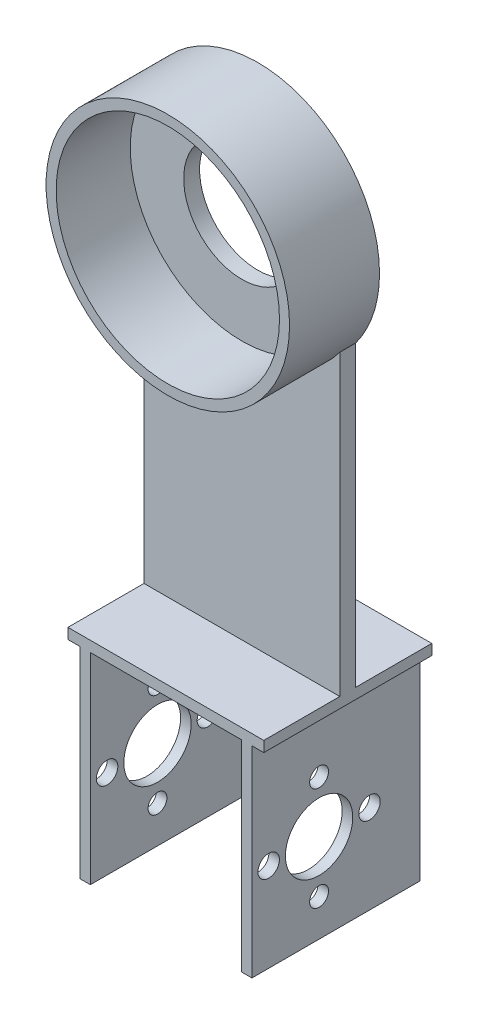
ISO-10303-21;
HEADER;
FILE_DESCRIPTION(('STEP AP214'),'2;1');
FILE_NAME('part.step','',(''),(''),'','','');
FILE_SCHEMA(('AUTOMOTIVE_DESIGN { 1 0 10303 214 1 1 1 1 }'));
ENDSEC;
DATA;
#1=APPLICATION_CONTEXT('core data for automotive mechanical design processes');
#2=APPLICATION_PROTOCOL_DEFINITION('international standard','automotive_design',2000,#1);
#3=PRODUCT_CONTEXT('',#1,'mechanical');
#4=PRODUCT('Part','Part','',(#3));
#5=PRODUCT_RELATED_PRODUCT_CATEGORY('part','',(#4));
#6=PRODUCT_DEFINITION_FORMATION('','',#4);
#7=PRODUCT_DEFINITION_CONTEXT('part definition',#1,'design');
#8=PRODUCT_DEFINITION('design','',#6,#7);
#9=PRODUCT_DEFINITION_SHAPE('','',#8);
#10=(LENGTH_UNIT() NAMED_UNIT(*) SI_UNIT(.MILLI.,.METRE.));
#11=(NAMED_UNIT(*) PLANE_ANGLE_UNIT() SI_UNIT($,.RADIAN.));
#12=(NAMED_UNIT(*) SI_UNIT($,.STERADIAN.) SOLID_ANGLE_UNIT());
#13=UNCERTAINTY_MEASURE_WITH_UNIT(LENGTH_MEASURE(1.E-05),#10,'distance_accuracy_value','');
#14=(GEOMETRIC_REPRESENTATION_CONTEXT(3) GLOBAL_UNCERTAINTY_ASSIGNED_CONTEXT((#13)) GLOBAL_UNIT_ASSIGNED_CONTEXT((#10,
#11,#12)) REPRESENTATION_CONTEXT('',''));
#15=CARTESIAN_POINT('',(0.,0.,0.));
#16=DIRECTION('',(0.,0.,1.));
#17=DIRECTION('',(1.,0.,0.));
#18=AXIS2_PLACEMENT_3D('',#15,#16,#17);
#19=CARTESIAN_POINT('',(0.,40.,0.));
#20=DIRECTION('',(0.,1.,0.));
#21=DIRECTION('',(0.,0.,1.));
#22=AXIS2_PLACEMENT_3D('',#19,#20,#21);
#23=PLANE('',#22);
#24=DIRECTION('',(-1.,0.,0.));
#25=VECTOR('',#24,1.);
#26=CARTESIAN_POINT('',(-5.30632757811611,40.,13.162349726776));
#27=LINE('',#26,#25);
#28=CARTESIAN_POINT('',(31.6936724218839,40.,13.162349726776));
#29=VERTEX_POINT('',#28);
#30=CARTESIAN_POINT('',(-5.30632757811611,40.,13.162349726776));
#31=VERTEX_POINT('',#30);
#32=EDGE_CURVE('E496',#29,#31,#27,.T.);
#33=ORIENTED_EDGE('',*,*,#32,.F.);
#34=DIRECTION('',(0.,0.,-1.));
#35=VECTOR('',#34,1.);
#36=CARTESIAN_POINT('',(31.6936724218839,40.,-1.20765027322405));
#37=LINE('',#36,#35);
#38=CARTESIAN_POINT('',(31.6936724218839,40.,-1.20765027322405));
#39=VERTEX_POINT('',#38);
#40=EDGE_CURVE('E493',#29,#39,#37,.T.);
#41=ORIENTED_EDGE('',*,*,#40,.T.);
#42=DIRECTION('',(-1.,0.,0.));
#43=VECTOR('',#42,1.);
#44=CARTESIAN_POINT('',(-3.07432757811612,40.,-1.20765027322404));
#45=LINE('',#44,#43);
#46=CARTESIAN_POINT('',(-5.30632757811611,40.,-1.20765027322404));
#47=VERTEX_POINT('',#46);
#48=EDGE_CURVE('E564',#39,#47,#45,.T.);
#49=ORIENTED_EDGE('',*,*,#48,.T.);
#50=DIRECTION('',(0.,0.,1.));
#51=VECTOR('',#50,1.);
#52=CARTESIAN_POINT('',(-5.30632757811611,40.,-1.20765027322404));
#53=LINE('',#52,#51);
#54=EDGE_CURVE('E544',#47,#31,#53,.T.);
#55=ORIENTED_EDGE('',*,*,#54,.T.);
#56=EDGE_LOOP('',(#33,#41,#49,#55));
#57=FACE_BOUND('',#56,.T.);
#58=ADVANCED_FACE('F360',(#57),#23,.T.);
#59=CARTESIAN_POINT('',(0.,38.,0.));
#60=DIRECTION('',(0.,1.,0.));
#61=DIRECTION('',(0.,0.,1.));
#62=AXIS2_PLACEMENT_3D('',#59,#60,#61);
#63=PLANE('',#62);
#64=DIRECTION('',(0.,0.,-1.));
#65=VECTOR('',#64,1.);
#66=CARTESIAN_POINT('',(27.4536724218839,38.,0.));
#67=LINE('',#66,#65);
#68=CARTESIAN_POINT('',(27.4536724218839,38.,30.532349726776));
#69=VERTEX_POINT('',#68);
#70=CARTESIAN_POINT('',(27.4536724218839,38.,-1.20765027322405));
#71=VERTEX_POINT('',#70);
#72=EDGE_CURVE('E369',#69,#71,#67,.T.);
#73=ORIENTED_EDGE('',*,*,#72,.F.);
#74=DIRECTION('',(1.,0.,0.));
#75=VECTOR('',#74,1.);
#76=CARTESIAN_POINT('',(-5.30632757811611,38.,30.532349726776));
#77=LINE('',#76,#75);
#78=CARTESIAN_POINT('',(-1.07432757811612,38.,30.532349726776));
#79=VERTEX_POINT('',#78);
#80=EDGE_CURVE('E535',#79,#69,#77,.T.);
#81=ORIENTED_EDGE('',*,*,#80,.F.);
#82=DIRECTION('',(0.,0.,-1.));
#83=VECTOR('',#82,1.);
#84=CARTESIAN_POINT('',(-1.07432757811612,38.,-1.20765027322404));
#85=LINE('',#84,#83);
#86=CARTESIAN_POINT('',(-1.07432757811612,38.,-1.20765027322404));
#87=VERTEX_POINT('',#86);
#88=EDGE_CURVE('E550',#79,#87,#85,.T.);
#89=ORIENTED_EDGE('',*,*,#88,.T.);
#90=DIRECTION('',(-1.,0.,0.));
#91=VECTOR('',#90,1.);
#92=CARTESIAN_POINT('',(-5.30632757811611,38.,-1.20765027322404));
#93=LINE('',#92,#91);
#94=EDGE_CURVE('E543',#71,#87,#93,.T.);
#95=ORIENTED_EDGE('',*,*,#94,.F.);
#96=EDGE_LOOP('',(#73,#81,#89,#95));
#97=FACE_BOUND('',#96,.T.);
#98=ADVANCED_FACE('F656',(#97),#63,.F.);
#99=DIRECTION('',(0.,0.,1.));
#100=VECTOR('',#99,1.);
#101=CARTESIAN_POINT('',(29.4536724218839,38.,0.));
#102=LINE('',#101,#100);
#103=CARTESIAN_POINT('',(29.4536724218839,38.,-1.20765027322405));
#104=VERTEX_POINT('',#103);
#105=CARTESIAN_POINT('',(29.4536724218839,38.,30.532349726776));
#106=VERTEX_POINT('',#105);
#107=EDGE_CURVE('E585',#104,#106,#102,.T.);
#108=ORIENTED_EDGE('',*,*,#107,.F.);
#109=CARTESIAN_POINT('',(31.6936724218839,38.,-1.20765027322405));
#110=VERTEX_POINT('',#109);
#111=EDGE_CURVE('E539',#110,#104,#93,.T.);
#112=ORIENTED_EDGE('',*,*,#111,.F.);
#113=DIRECTION('',(0.,0.,-1.));
#114=VECTOR('',#113,1.);
#115=CARTESIAN_POINT('',(31.6936724218839,38.,-1.20765027322405));
#116=LINE('',#115,#114);
#117=CARTESIAN_POINT('',(31.6936724218839,38.,30.532349726776));
#118=VERTEX_POINT('',#117);
#119=EDGE_CURVE('E534',#118,#110,#116,.T.);
#120=ORIENTED_EDGE('',*,*,#119,.F.);
#121=EDGE_CURVE('E530',#106,#118,#77,.T.);
#122=ORIENTED_EDGE('',*,*,#121,.F.);
#123=EDGE_LOOP('',(#108,#112,#120,#122));
#124=FACE_BOUND('',#123,.T.);
#125=ADVANCED_FACE('F662',(#124),#63,.F.);
#126=CARTESIAN_POINT('',(-3.07432757811612,40.,-1.20765027322404));
#127=DIRECTION('',(1.,0.,0.));
#128=DIRECTION('',(0.,0.,-1.));
#129=AXIS2_PLACEMENT_3D('',#126,#127,#128);
#130=PLANE('',#129);
#131=CARTESIAN_POINT('',(-3.07432757811612,26.5588781391116,17.8423497267726));
#132=DIRECTION('',(1.,0.,0.));
#133=DIRECTION('',(0.,0.,-1.));
#134=AXIS2_PLACEMENT_3D('',#131,#132,#133);
#135=CIRCLE('',#134,1.78);
#136=CARTESIAN_POINT('',(-3.07432757811612,26.5588781391116,16.0623497267726));
#137=VERTEX_POINT('',#136);
#138=EDGE_CURVE('E500',#137,#137,#135,.T.);
#139=ORIENTED_EDGE('',*,*,#138,.T.);
#140=EDGE_LOOP('',(#139));
#141=FACE_BOUND('',#140,.T.);
#142=CARTESIAN_POINT('',(-3.07432757811612,7.00087813911163,17.8423497267726));
#143=DIRECTION('',(1.,0.,0.));
#144=DIRECTION('',(0.,0.,-1.));
#145=AXIS2_PLACEMENT_3D('',#142,#143,#144);
#146=CIRCLE('',#145,1.78);
#147=CARTESIAN_POINT('',(-3.07432757811612,7.00087813911163,16.0623497267726));
#148=VERTEX_POINT('',#147);
#149=EDGE_CURVE('E612',#148,#148,#146,.T.);
#150=ORIENTED_EDGE('',*,*,#149,.T.);
#151=EDGE_LOOP('',(#150));
#152=FACE_BOUND('',#151,.T.);
#153=CARTESIAN_POINT('',(-3.07432757811612,16.7798781391116,27.3673497267725));
#154=DIRECTION('',(1.,0.,0.));
#155=DIRECTION('',(0.,0.,-1.));
#156=AXIS2_PLACEMENT_3D('',#153,#154,#155);
#157=CIRCLE('',#156,2.03);
#158=CARTESIAN_POINT('',(-3.07432757811612,16.7798781391116,25.3373497267725));
#159=VERTEX_POINT('',#158);
#160=EDGE_CURVE('E608',#159,#159,#157,.T.);
#161=ORIENTED_EDGE('',*,*,#160,.T.);
#162=EDGE_LOOP('',(#161));
#163=FACE_BOUND('',#162,.T.);
#164=CARTESIAN_POINT('',(-3.07432757811612,16.7798781391116,8.31734972677252));
#165=DIRECTION('',(1.,0.,0.));
#166=DIRECTION('',(0.,0.,-1.));
#167=AXIS2_PLACEMENT_3D('',#164,#165,#166);
#168=CIRCLE('',#167,2.03);
#169=CARTESIAN_POINT('',(-3.07432757811612,16.7798781391116,6.28734972677252));
#170=VERTEX_POINT('',#169);
#171=EDGE_CURVE('E603',#170,#170,#168,.T.);
#172=ORIENTED_EDGE('',*,*,#171,.T.);
#173=EDGE_LOOP('',(#172));
#174=FACE_BOUND('',#173,.T.);
#175=CARTESIAN_POINT('',(-3.07432757811612,16.7798781391116,17.8423497267726));
#176=DIRECTION('',(1.,0.,0.));
#177=DIRECTION('',(0.,0.,-1.));
#178=AXIS2_PLACEMENT_3D('',#175,#176,#177);
#179=CIRCLE('',#178,6.36);
#180=CARTESIAN_POINT('',(-3.07432757811612,16.7798781391116,11.4823497267726));
#181=VERTEX_POINT('',#180);
#182=EDGE_CURVE('E598',#181,#181,#179,.T.);
#183=ORIENTED_EDGE('',*,*,#182,.T.);
#184=EDGE_LOOP('',(#183));
#185=FACE_BOUND('',#184,.T.);
#186=DIRECTION('',(0.,0.,1.));
#187=VECTOR('',#186,1.);
#188=CARTESIAN_POINT('',(-3.07432757811612,38.,-1.20765027322404));
#189=LINE('',#188,#187);
#190=CARTESIAN_POINT('',(-3.07432757811612,38.,-1.20765027322404));
#191=VERTEX_POINT('',#190);
#192=CARTESIAN_POINT('',(-3.07432757811612,38.,30.532349726776));
#193=VERTEX_POINT('',#192);
#194=EDGE_CURVE('E560',#191,#193,#189,.T.);
#195=ORIENTED_EDGE('',*,*,#194,.F.);
#196=DIRECTION('',(0.,-1.,0.));
#197=VECTOR('',#196,1.);
#198=CARTESIAN_POINT('',(-3.07432757811612,40.,-1.20765027322404));
#199=LINE('',#198,#197);
#200=CARTESIAN_POINT('',(-3.07432757811612,0.,-1.20765027322404));
#201=VERTEX_POINT('',#200);
#202=EDGE_CURVE('E567',#191,#201,#199,.T.);
#203=ORIENTED_EDGE('',*,*,#202,.T.);
#204=DIRECTION('',(0.,0.,1.));
#205=VECTOR('',#204,1.);
#206=CARTESIAN_POINT('',(-3.07432757811612,0.,-1.20765027322404));
#207=LINE('',#206,#205);
#208=CARTESIAN_POINT('',(-3.07432757811612,0.,30.532349726776));
#209=VERTEX_POINT('',#208);
#210=EDGE_CURVE('E562',#201,#209,#207,.T.);
#211=ORIENTED_EDGE('',*,*,#210,.T.);
#212=DIRECTION('',(0.,-1.,0.));
#213=VECTOR('',#212,1.);
#214=CARTESIAN_POINT('',(-3.07432757811612,40.,30.532349726776));
#215=LINE('',#214,#213);
#216=EDGE_CURVE('E583',#193,#209,#215,.T.);
#217=ORIENTED_EDGE('',*,*,#216,.F.);
#218=EDGE_LOOP('',(#195,#203,#211,#217));
#219=FACE_BOUND('',#218,.T.);
#220=ADVANCED_FACE('F362',(#141,#152,#163,#174,#185,#219),#130,.F.);
#221=CARTESIAN_POINT('',(-1.07432757811612,40.,-1.20765027322404));
#222=DIRECTION('',(-1.,0.,0.));
#223=DIRECTION('',(0.,0.,1.));
#224=AXIS2_PLACEMENT_3D('',#221,#222,#223);
#225=PLANE('',#224);
#226=CARTESIAN_POINT('',(-1.07432757811612,26.5588781391116,17.8423497267726));
#227=DIRECTION('',(-1.,0.,0.));
#228=DIRECTION('',(0.,0.,1.));
#229=AXIS2_PLACEMENT_3D('',#226,#227,#228);
#230=CIRCLE('',#229,1.78);
#231=CARTESIAN_POINT('',(-1.07432757811612,26.5588781391116,19.6223497267726));
#232=VERTEX_POINT('',#231);
#233=EDGE_CURVE('E616',#232,#232,#230,.T.);
#234=ORIENTED_EDGE('',*,*,#233,.T.);
#235=EDGE_LOOP('',(#234));
#236=FACE_BOUND('',#235,.T.);
#237=CARTESIAN_POINT('',(-1.07432757811612,7.00087813911163,17.8423497267726));
#238=DIRECTION('',(-1.,0.,0.));
#239=DIRECTION('',(0.,0.,1.));
#240=AXIS2_PLACEMENT_3D('',#237,#238,#239);
#241=CIRCLE('',#240,1.78);
#242=CARTESIAN_POINT('',(-1.07432757811612,7.00087813911163,19.6223497267726));
#243=VERTEX_POINT('',#242);
#244=EDGE_CURVE('E619',#243,#243,#241,.T.);
#245=ORIENTED_EDGE('',*,*,#244,.T.);
#246=EDGE_LOOP('',(#245));
#247=FACE_BOUND('',#246,.T.);
#248=CARTESIAN_POINT('',(-1.07432757811612,16.7798781391116,27.3673497267725));
#249=DIRECTION('',(-1.,0.,0.));
#250=DIRECTION('',(0.,0.,1.));
#251=AXIS2_PLACEMENT_3D('',#248,#249,#250);
#252=CIRCLE('',#251,2.03);
#253=CARTESIAN_POINT('',(-1.07432757811612,16.7798781391116,29.3973497267725));
#254=VERTEX_POINT('',#253);
#255=EDGE_CURVE('E697',#254,#254,#252,.T.);
#256=ORIENTED_EDGE('',*,*,#255,.T.);
#257=EDGE_LOOP('',(#256));
#258=FACE_BOUND('',#257,.T.);
#259=CARTESIAN_POINT('',(-1.07432757811612,16.7798781391116,8.31734972677252));
#260=DIRECTION('',(-1.,0.,0.));
#261=DIRECTION('',(0.,0.,1.));
#262=AXIS2_PLACEMENT_3D('',#259,#260,#261);
#263=CIRCLE('',#262,2.03);
#264=CARTESIAN_POINT('',(-1.07432757811612,16.7798781391116,10.3473497267725));
#265=VERTEX_POINT('',#264);
#266=EDGE_CURVE('E701',#265,#265,#263,.T.);
#267=ORIENTED_EDGE('',*,*,#266,.T.);
#268=EDGE_LOOP('',(#267));
#269=FACE_BOUND('',#268,.T.);
#270=CARTESIAN_POINT('',(-1.07432757811612,16.7798781391116,17.8423497267726));
#271=DIRECTION('',(-1.,0.,0.));
#272=DIRECTION('',(0.,0.,1.));
#273=AXIS2_PLACEMENT_3D('',#270,#271,#272);
#274=CIRCLE('',#273,6.36);
#275=CARTESIAN_POINT('',(-1.07432757811612,16.7798781391116,24.2023497267726));
#276=VERTEX_POINT('',#275);
#277=EDGE_CURVE('E705',#276,#276,#274,.T.);
#278=ORIENTED_EDGE('',*,*,#277,.T.);
#279=EDGE_LOOP('',(#278));
#280=FACE_BOUND('',#279,.T.);
#281=ORIENTED_EDGE('',*,*,#88,.F.);
#282=DIRECTION('',(0.,-1.,0.));
#283=VECTOR('',#282,1.);
#284=CARTESIAN_POINT('',(-1.07432757811612,40.,30.532349726776));
#285=LINE('',#284,#283);
#286=CARTESIAN_POINT('',(-1.07432757811612,0.,30.532349726776));
#287=VERTEX_POINT('',#286);
#288=EDGE_CURVE('E581',#79,#287,#285,.T.);
#289=ORIENTED_EDGE('',*,*,#288,.T.);
#290=DIRECTION('',(0.,0.,-1.));
#291=VECTOR('',#290,1.);
#292=CARTESIAN_POINT('',(-1.07432757811612,0.,-1.20765027322404));
#293=LINE('',#292,#291);
#294=CARTESIAN_POINT('',(-1.07432757811612,0.,-1.20765027322404));
#295=VERTEX_POINT('',#294);
#296=EDGE_CURVE('E573',#287,#295,#293,.T.);
#297=ORIENTED_EDGE('',*,*,#296,.T.);
#298=DIRECTION('',(0.,-1.,0.));
#299=VECTOR('',#298,1.);
#300=CARTESIAN_POINT('',(-1.07432757811612,40.,-1.20765027322404));
#301=LINE('',#300,#299);
#302=EDGE_CURVE('E579',#87,#295,#301,.T.);
#303=ORIENTED_EDGE('',*,*,#302,.F.);
#304=EDGE_LOOP('',(#281,#289,#297,#303));
#305=FACE_BOUND('',#304,.T.);
#306=ADVANCED_FACE('F683',(#236,#247,#258,#269,#280,#305),#225,.F.);
#307=CARTESIAN_POINT('',(-3.07432757811612,40.,30.532349726776));
#308=DIRECTION('',(0.,0.,-1.));
#309=DIRECTION('',(-1.,0.,0.));
#310=AXIS2_PLACEMENT_3D('',#307,#308,#309);
#311=PLANE('',#310);
#312=DIRECTION('',(0.,1.,0.));
#313=VECTOR('',#312,1.);
#314=CARTESIAN_POINT('',(31.6936724218839,38.,30.532349726776));
#315=LINE('',#314,#313);
#316=CARTESIAN_POINT('',(31.6936724218839,40.,30.532349726776));
#317=VERTEX_POINT('',#316);
#318=EDGE_CURVE('E554',#118,#317,#315,.T.);
#319=ORIENTED_EDGE('',*,*,#318,.T.);
#320=DIRECTION('',(1.,0.,0.));
#321=VECTOR('',#320,1.);
#322=CARTESIAN_POINT('',(-3.07432757811612,40.,30.532349726776));
#323=LINE('',#322,#321);
#324=CARTESIAN_POINT('',(-5.30632757811611,40.,30.532349726776));
#325=VERTEX_POINT('',#324);
#326=EDGE_CURVE('E490',#325,#317,#323,.T.);
#327=ORIENTED_EDGE('',*,*,#326,.F.);
#328=DIRECTION('',(0.,1.,0.));
#329=VECTOR('',#328,1.);
#330=CARTESIAN_POINT('',(-5.30632757811611,38.,30.532349726776));
#331=LINE('',#330,#329);
#332=CARTESIAN_POINT('',(-5.30632757811611,38.,30.532349726776));
#333=VERTEX_POINT('',#332);
#334=EDGE_CURVE('E542',#333,#325,#331,.T.);
#335=ORIENTED_EDGE('',*,*,#334,.F.);
#336=EDGE_CURVE('E531',#333,#193,#77,.T.);
#337=ORIENTED_EDGE('',*,*,#336,.T.);
#338=ORIENTED_EDGE('',*,*,#216,.T.);
#339=DIRECTION('',(1.,0.,0.));
#340=VECTOR('',#339,1.);
#341=CARTESIAN_POINT('',(-3.07432757811612,0.,30.532349726776));
#342=LINE('',#341,#340);
#343=EDGE_CURVE('E570',#209,#287,#342,.T.);
#344=ORIENTED_EDGE('',*,*,#343,.T.);
#345=ORIENTED_EDGE('',*,*,#288,.F.);
#346=ORIENTED_EDGE('',*,*,#80,.T.);
#347=DIRECTION('',(0.,-1.,0.));
#348=VECTOR('',#347,1.);
#349=CARTESIAN_POINT('',(27.4536724218839,40.,30.532349726776));
#350=LINE('',#349,#348);
#351=CARTESIAN_POINT('',(27.4536724218839,0.,30.532349726776));
#352=VERTEX_POINT('',#351);
#353=EDGE_CURVE('E509',#69,#352,#350,.T.);
#354=ORIENTED_EDGE('',*,*,#353,.T.);
#355=DIRECTION('',(1.,0.,0.));
#356=VECTOR('',#355,1.);
#357=CARTESIAN_POINT('',(29.4536724218839,0.,30.532349726776));
#358=LINE('',#357,#356);
#359=CARTESIAN_POINT('',(29.4536724218839,0.,30.532349726776));
#360=VERTEX_POINT('',#359);
#361=EDGE_CURVE('E518',#352,#360,#358,.T.);
#362=ORIENTED_EDGE('',*,*,#361,.T.);
#363=DIRECTION('',(0.,-1.,0.));
#364=VECTOR('',#363,1.);
#365=CARTESIAN_POINT('',(29.4536724218839,40.,30.532349726776));
#366=LINE('',#365,#364);
#367=EDGE_CURVE('E511',#106,#360,#366,.T.);
#368=ORIENTED_EDGE('',*,*,#367,.F.);
#369=ORIENTED_EDGE('',*,*,#121,.T.);
#370=EDGE_LOOP('',(#319,#327,#335,#337,#338,#344,#345,#346,#354,#362,#368,#369));
#371=FACE_BOUND('',#370,.T.);
#372=ADVANCED_FACE('F677',(#371),#311,.F.);
#373=CARTESIAN_POINT('',(-3.07432757811612,40.,-1.20765027322404));
#374=DIRECTION('',(0.,0.,1.));
#375=DIRECTION('',(1.,0.,0.));
#376=AXIS2_PLACEMENT_3D('',#373,#374,#375);
#377=PLANE('',#376);
#378=DIRECTION('',(0.,1.,0.));
#379=VECTOR('',#378,1.);
#380=CARTESIAN_POINT('',(-5.30632757811611,38.,-1.20765027322404));
#381=LINE('',#380,#379);
#382=CARTESIAN_POINT('',(-5.30632757811611,38.,-1.20765027322404));
#383=VERTEX_POINT('',#382);
#384=EDGE_CURVE('E547',#383,#47,#381,.T.);
#385=ORIENTED_EDGE('',*,*,#384,.T.);
#386=ORIENTED_EDGE('',*,*,#48,.F.);
#387=DIRECTION('',(0.,1.,0.));
#388=VECTOR('',#387,1.);
#389=CARTESIAN_POINT('',(31.6936724218839,38.,-1.20765027322405));
#390=LINE('',#389,#388);
#391=EDGE_CURVE('E551',#110,#39,#390,.T.);
#392=ORIENTED_EDGE('',*,*,#391,.F.);
#393=ORIENTED_EDGE('',*,*,#111,.T.);
#394=DIRECTION('',(0.,-1.,0.));
#395=VECTOR('',#394,1.);
#396=CARTESIAN_POINT('',(29.4536724218839,40.,-1.20765027322404));
#397=LINE('',#396,#395);
#398=CARTESIAN_POINT('',(29.4536724218839,0.,-1.20765027322404));
#399=VERTEX_POINT('',#398);
#400=EDGE_CURVE('E513',#104,#399,#397,.T.);
#401=ORIENTED_EDGE('',*,*,#400,.T.);
#402=DIRECTION('',(-1.,0.,0.));
#403=VECTOR('',#402,1.);
#404=CARTESIAN_POINT('',(29.4536724218839,0.,-1.20765027322404));
#405=LINE('',#404,#403);
#406=CARTESIAN_POINT('',(27.4536724218839,0.,-1.20765027322404));
#407=VERTEX_POINT('',#406);
#408=EDGE_CURVE('E524',#399,#407,#405,.T.);
#409=ORIENTED_EDGE('',*,*,#408,.T.);
#410=DIRECTION('',(0.,-1.,0.));
#411=VECTOR('',#410,1.);
#412=CARTESIAN_POINT('',(27.4536724218839,40.,-1.20765027322404));
#413=LINE('',#412,#411);
#414=EDGE_CURVE('E507',#71,#407,#413,.T.);
#415=ORIENTED_EDGE('',*,*,#414,.F.);
#416=ORIENTED_EDGE('',*,*,#94,.T.);
#417=ORIENTED_EDGE('',*,*,#302,.T.);
#418=DIRECTION('',(-1.,0.,0.));
#419=VECTOR('',#418,1.);
#420=CARTESIAN_POINT('',(-3.07432757811612,0.,-1.20765027322404));
#421=LINE('',#420,#419);
#422=EDGE_CURVE('E565',#295,#201,#421,.T.);
#423=ORIENTED_EDGE('',*,*,#422,.T.);
#424=ORIENTED_EDGE('',*,*,#202,.F.);
#425=EDGE_CURVE('E538',#191,#383,#93,.T.);
#426=ORIENTED_EDGE('',*,*,#425,.T.);
#427=EDGE_LOOP('',(#385,#386,#392,#393,#401,#409,#415,#416,#417,#423,#424,#426));
#428=FACE_BOUND('',#427,.T.);
#429=ADVANCED_FACE('F671',(#428),#377,.F.);
#430=DIRECTION('',(1.,0.,0.));
#431=VECTOR('',#430,1.);
#432=CARTESIAN_POINT('',(-5.30632757811611,40.,16.162349726776));
#433=LINE('',#432,#431);
#434=CARTESIAN_POINT('',(-5.30632757811611,40.,16.162349726776));
#435=VERTEX_POINT('',#434);
#436=CARTESIAN_POINT('',(31.6936724218839,40.,16.1623497267759));
#437=VERTEX_POINT('',#436);
#438=EDGE_CURVE('E487',#435,#437,#433,.T.);
#439=ORIENTED_EDGE('',*,*,#438,.F.);
#440=EDGE_CURVE('E527',#435,#325,#53,.T.);
#441=ORIENTED_EDGE('',*,*,#440,.T.);
#442=ORIENTED_EDGE('',*,*,#326,.T.);
#443=EDGE_CURVE('E477',#317,#437,#37,.T.);
#444=ORIENTED_EDGE('',*,*,#443,.T.);
#445=EDGE_LOOP('',(#439,#441,#442,#444));
#446=FACE_BOUND('',#445,.T.);
#447=ADVANCED_FACE('F486',(#446),#23,.T.);
#448=CARTESIAN_POINT('',(0.,0.,0.));
#449=DIRECTION('',(0.,1.,0.));
#450=DIRECTION('',(0.,0.,1.));
#451=AXIS2_PLACEMENT_3D('',#448,#449,#450);
#452=PLANE('',#451);
#453=ORIENTED_EDGE('',*,*,#210,.F.);
#454=ORIENTED_EDGE('',*,*,#422,.F.);
#455=ORIENTED_EDGE('',*,*,#296,.F.);
#456=ORIENTED_EDGE('',*,*,#343,.F.);
#457=EDGE_LOOP('',(#453,#454,#455,#456));
#458=FACE_BOUND('',#457,.T.);
#459=ADVANCED_FACE('F670',(#458),#452,.F.);
#460=CARTESIAN_POINT('',(31.6936724218839,38.,-1.20765027322405));
#461=DIRECTION('',(1.,0.,0.));
#462=DIRECTION('',(0.,0.,-1.));
#463=AXIS2_PLACEMENT_3D('',#460,#461,#462);
#464=PLANE('',#463);
#465=DIRECTION('',(0.,0.,1.));
#466=VECTOR('',#465,1.);
#467=CARTESIAN_POINT('',(31.6936724218839,96.3343496312836,13.1623497267759));
#468=LINE('',#467,#466);
#469=CARTESIAN_POINT('',(31.6936724218839,96.3343496312836,16.1623497267759));
#470=VERTEX_POINT('',#469);
#471=CARTESIAN_POINT('',(31.6936724218839,96.3343496312836,13.162349726776));
#472=VERTEX_POINT('',#471);
#473=EDGE_CURVE('E478',#470,#472,#468,.F.);
#474=ORIENTED_EDGE('',*,*,#473,.F.);
#475=DIRECTION('',(0.,-1.,0.));
#476=VECTOR('',#475,1.);
#477=CARTESIAN_POINT('',(31.6936724218839,110.,16.1623497267759));
#478=LINE('',#477,#476);
#479=EDGE_CURVE('E473',#470,#437,#478,.T.);
#480=ORIENTED_EDGE('',*,*,#479,.T.);
#481=ORIENTED_EDGE('',*,*,#443,.F.);
#482=ORIENTED_EDGE('',*,*,#318,.F.);
#483=ORIENTED_EDGE('',*,*,#119,.T.);
#484=ORIENTED_EDGE('',*,*,#391,.T.);
#485=ORIENTED_EDGE('',*,*,#40,.F.);
#486=DIRECTION('',(0.,-1.,0.));
#487=VECTOR('',#486,1.);
#488=CARTESIAN_POINT('',(31.6936724218839,110.,13.162349726776));
#489=LINE('',#488,#487);
#490=EDGE_CURVE('E376',#472,#29,#489,.T.);
#491=ORIENTED_EDGE('',*,*,#490,.F.);
#492=EDGE_LOOP('',(#474,#480,#481,#482,#483,#484,#485,#491));
#493=FACE_BOUND('',#492,.T.);
#494=ADVANCED_FACE('F475',(#493),#464,.T.);
#495=ORIENTED_EDGE('',*,*,#425,.F.);
#496=ORIENTED_EDGE('',*,*,#194,.T.);
#497=ORIENTED_EDGE('',*,*,#336,.F.);
#498=DIRECTION('',(0.,0.,1.));
#499=VECTOR('',#498,1.);
#500=CARTESIAN_POINT('',(-5.30632757811611,38.,-1.20765027322404));
#501=LINE('',#500,#499);
#502=EDGE_CURVE('E492',#383,#333,#501,.T.);
#503=ORIENTED_EDGE('',*,*,#502,.F.);
#504=EDGE_LOOP('',(#495,#496,#497,#503));
#505=FACE_BOUND('',#504,.T.);
#506=ADVANCED_FACE('F665',(#505),#63,.F.);
#507=CARTESIAN_POINT('',(-5.30632757811611,38.,-1.20765027322404));
#508=DIRECTION('',(-1.,0.,0.));
#509=DIRECTION('',(0.,0.,1.));
#510=AXIS2_PLACEMENT_3D('',#507,#508,#509);
#511=PLANE('',#510);
#512=DIRECTION('',(0.,0.,1.));
#513=VECTOR('',#512,1.);
#514=CARTESIAN_POINT('',(-5.30632757811611,96.3343496312836,13.162349726776));
#515=LINE('',#514,#513);
#516=CARTESIAN_POINT('',(-5.30632757811612,96.3343496312836,13.162349726776));
#517=VERTEX_POINT('',#516);
#518=CARTESIAN_POINT('',(-5.30632757811611,96.3343496312836,16.162349726776));
#519=VERTEX_POINT('',#518);
#520=EDGE_CURVE('E384',#517,#519,#515,.T.);
#521=ORIENTED_EDGE('',*,*,#520,.F.);
#522=DIRECTION('',(0.,-1.,0.));
#523=VECTOR('',#522,1.);
#524=CARTESIAN_POINT('',(-5.30632757811611,110.,13.162349726776));
#525=LINE('',#524,#523);
#526=EDGE_CURVE('E505',#517,#31,#525,.T.);
#527=ORIENTED_EDGE('',*,*,#526,.T.);
#528=ORIENTED_EDGE('',*,*,#54,.F.);
#529=ORIENTED_EDGE('',*,*,#384,.F.);
#530=ORIENTED_EDGE('',*,*,#502,.T.);
#531=ORIENTED_EDGE('',*,*,#334,.T.);
#532=ORIENTED_EDGE('',*,*,#440,.F.);
#533=DIRECTION('',(0.,-1.,0.));
#534=VECTOR('',#533,1.);
#535=CARTESIAN_POINT('',(-5.30632757811611,110.,16.162349726776));
#536=LINE('',#535,#534);
#537=EDGE_CURVE('E482',#519,#435,#536,.T.);
#538=ORIENTED_EDGE('',*,*,#537,.F.);
#539=EDGE_LOOP('',(#521,#527,#528,#529,#530,#531,#532,#538));
#540=FACE_BOUND('',#539,.T.);
#541=ADVANCED_FACE('F724',(#540),#511,.T.);
#542=CARTESIAN_POINT('',(27.4536724218839,40.,-1.20765027322404));
#543=DIRECTION('',(1.,0.,0.));
#544=DIRECTION('',(0.,0.,-1.));
#545=AXIS2_PLACEMENT_3D('',#542,#543,#544);
#546=PLANE('',#545);
#547=CARTESIAN_POINT('',(27.4536724218839,26.5588781391116,17.8423497267726));
#548=DIRECTION('',(1.,0.,0.));
#549=DIRECTION('',(0.,0.,-1.));
#550=AXIS2_PLACEMENT_3D('',#547,#548,#549);
#551=CIRCLE('',#550,1.78);
#552=CARTESIAN_POINT('',(27.4536724218839,26.5588781391116,16.0623497267726));
#553=VERTEX_POINT('',#552);
#554=EDGE_CURVE('E611',#553,#553,#551,.T.);
#555=ORIENTED_EDGE('',*,*,#554,.T.);
#556=EDGE_LOOP('',(#555));
#557=FACE_BOUND('',#556,.T.);
#558=CARTESIAN_POINT('',(27.4536724218839,7.00087813911163,17.8423497267726));
#559=DIRECTION('',(1.,0.,0.));
#560=DIRECTION('',(0.,0.,-1.));
#561=AXIS2_PLACEMENT_3D('',#558,#559,#560);
#562=CIRCLE('',#561,1.78);
#563=CARTESIAN_POINT('',(27.4536724218839,7.00087813911163,16.0623497267726));
#564=VERTEX_POINT('',#563);
#565=EDGE_CURVE('E607',#564,#564,#562,.T.);
#566=ORIENTED_EDGE('',*,*,#565,.T.);
#567=EDGE_LOOP('',(#566));
#568=FACE_BOUND('',#567,.T.);
#569=CARTESIAN_POINT('',(27.4536724218839,16.7798781391116,27.3673497267725));
#570=DIRECTION('',(1.,0.,0.));
#571=DIRECTION('',(0.,0.,-1.));
#572=AXIS2_PLACEMENT_3D('',#569,#570,#571);
#573=CIRCLE('',#572,2.03);
#574=CARTESIAN_POINT('',(27.4536724218839,16.7798781391116,25.3373497267725));
#575=VERTEX_POINT('',#574);
#576=EDGE_CURVE('E602',#575,#575,#573,.T.);
#577=ORIENTED_EDGE('',*,*,#576,.T.);
#578=EDGE_LOOP('',(#577));
#579=FACE_BOUND('',#578,.T.);
#580=CARTESIAN_POINT('',(27.4536724218839,16.7798781391116,8.31734972677252));
#581=DIRECTION('',(1.,0.,0.));
#582=DIRECTION('',(0.,0.,-1.));
#583=AXIS2_PLACEMENT_3D('',#580,#581,#582);
#584=CIRCLE('',#583,2.03);
#585=CARTESIAN_POINT('',(27.4536724218839,16.7798781391116,6.28734972677252));
#586=VERTEX_POINT('',#585);
#587=EDGE_CURVE('E597',#586,#586,#584,.T.);
#588=ORIENTED_EDGE('',*,*,#587,.T.);
#589=EDGE_LOOP('',(#588));
#590=FACE_BOUND('',#589,.T.);
#591=CARTESIAN_POINT('',(27.4536724218839,16.7798781391116,17.8423497267726));
#592=DIRECTION('',(1.,0.,0.));
#593=DIRECTION('',(0.,0.,-1.));
#594=AXIS2_PLACEMENT_3D('',#591,#592,#593);
#595=CIRCLE('',#594,6.36);
#596=CARTESIAN_POINT('',(27.4536724218839,16.7798781391116,11.4823497267726));
#597=VERTEX_POINT('',#596);
#598=EDGE_CURVE('E593',#597,#597,#595,.T.);
#599=ORIENTED_EDGE('',*,*,#598,.T.);
#600=EDGE_LOOP('',(#599));
#601=FACE_BOUND('',#600,.T.);
#602=ORIENTED_EDGE('',*,*,#353,.F.);
#603=ORIENTED_EDGE('',*,*,#72,.T.);
#604=ORIENTED_EDGE('',*,*,#414,.T.);
#605=DIRECTION('',(0.,0.,1.));
#606=VECTOR('',#605,1.);
#607=CARTESIAN_POINT('',(27.4536724218839,0.,-1.20765027322404));
#608=LINE('',#607,#606);
#609=EDGE_CURVE('E521',#407,#352,#608,.T.);
#610=ORIENTED_EDGE('',*,*,#609,.T.);
#611=EDGE_LOOP('',(#602,#603,#604,#610));
#612=FACE_BOUND('',#611,.T.);
#613=ADVANCED_FACE('F754',(#557,#568,#579,#590,#601,#612),#546,.F.);
#614=CARTESIAN_POINT('',(29.4536724218839,40.,-1.20765027322404));
#615=DIRECTION('',(-1.,0.,0.));
#616=DIRECTION('',(0.,0.,1.));
#617=AXIS2_PLACEMENT_3D('',#614,#615,#616);
#618=PLANE('',#617);
#619=CARTESIAN_POINT('',(29.4536724218839,26.5588781391116,17.8423497267726));
#620=DIRECTION('',(-1.,0.,0.));
#621=DIRECTION('',(0.,0.,1.));
#622=AXIS2_PLACEMENT_3D('',#619,#620,#621);
#623=CIRCLE('',#622,1.78);
#624=CARTESIAN_POINT('',(29.4536724218839,26.5588781391116,19.6223497267726));
#625=VERTEX_POINT('',#624);
#626=EDGE_CURVE('E609',#625,#625,#623,.T.);
#627=ORIENTED_EDGE('',*,*,#626,.T.);
#628=EDGE_LOOP('',(#627));
#629=FACE_BOUND('',#628,.T.);
#630=CARTESIAN_POINT('',(29.4536724218839,7.00087813911163,17.8423497267726));
#631=DIRECTION('',(-1.,0.,0.));
#632=DIRECTION('',(0.,0.,1.));
#633=AXIS2_PLACEMENT_3D('',#630,#631,#632);
#634=CIRCLE('',#633,1.78);
#635=CARTESIAN_POINT('',(29.4536724218839,7.00087813911163,19.6223497267726));
#636=VERTEX_POINT('',#635);
#637=EDGE_CURVE('E604',#636,#636,#634,.T.);
#638=ORIENTED_EDGE('',*,*,#637,.T.);
#639=EDGE_LOOP('',(#638));
#640=FACE_BOUND('',#639,.T.);
#641=CARTESIAN_POINT('',(29.4536724218839,16.7798781391116,27.3673497267725));
#642=DIRECTION('',(-1.,0.,0.));
#643=DIRECTION('',(0.,0.,1.));
#644=AXIS2_PLACEMENT_3D('',#641,#642,#643);
#645=CIRCLE('',#644,2.03);
#646=CARTESIAN_POINT('',(29.4536724218839,16.7798781391116,29.3973497267725));
#647=VERTEX_POINT('',#646);
#648=EDGE_CURVE('E599',#647,#647,#645,.T.);
#649=ORIENTED_EDGE('',*,*,#648,.T.);
#650=EDGE_LOOP('',(#649));
#651=FACE_BOUND('',#650,.T.);
#652=CARTESIAN_POINT('',(29.4536724218839,16.7798781391116,8.31734972677252));
#653=DIRECTION('',(-1.,0.,0.));
#654=DIRECTION('',(0.,0.,1.));
#655=AXIS2_PLACEMENT_3D('',#652,#653,#654);
#656=CIRCLE('',#655,2.03);
#657=CARTESIAN_POINT('',(29.4536724218839,16.7798781391116,10.3473497267725));
#658=VERTEX_POINT('',#657);
#659=EDGE_CURVE('E594',#658,#658,#656,.T.);
#660=ORIENTED_EDGE('',*,*,#659,.T.);
#661=EDGE_LOOP('',(#660));
#662=FACE_BOUND('',#661,.T.);
#663=CARTESIAN_POINT('',(29.4536724218839,16.7798781391116,17.8423497267726));
#664=DIRECTION('',(-1.,0.,0.));
#665=DIRECTION('',(0.,0.,1.));
#666=AXIS2_PLACEMENT_3D('',#663,#664,#665);
#667=CIRCLE('',#666,6.36);
#668=CARTESIAN_POINT('',(29.4536724218839,16.7798781391116,24.2023497267726));
#669=VERTEX_POINT('',#668);
#670=EDGE_CURVE('E590',#669,#669,#667,.T.);
#671=ORIENTED_EDGE('',*,*,#670,.T.);
#672=EDGE_LOOP('',(#671));
#673=FACE_BOUND('',#672,.T.);
#674=ORIENTED_EDGE('',*,*,#400,.F.);
#675=ORIENTED_EDGE('',*,*,#107,.T.);
#676=ORIENTED_EDGE('',*,*,#367,.T.);
#677=DIRECTION('',(0.,0.,-1.));
#678=VECTOR('',#677,1.);
#679=CARTESIAN_POINT('',(29.4536724218839,0.,-1.20765027322404));
#680=LINE('',#679,#678);
#681=EDGE_CURVE('E515',#360,#399,#680,.T.);
#682=ORIENTED_EDGE('',*,*,#681,.T.);
#683=EDGE_LOOP('',(#674,#675,#676,#682));
#684=FACE_BOUND('',#683,.T.);
#685=ADVANCED_FACE('F782',(#629,#640,#651,#662,#673,#684),#618,.F.);
#686=CARTESIAN_POINT('',(0.,0.,0.));
#687=DIRECTION('',(0.,1.,0.));
#688=DIRECTION('',(0.,0.,1.));
#689=AXIS2_PLACEMENT_3D('',#686,#687,#688);
#690=PLANE('',#689);
#691=ORIENTED_EDGE('',*,*,#408,.F.);
#692=ORIENTED_EDGE('',*,*,#681,.F.);
#693=ORIENTED_EDGE('',*,*,#361,.F.);
#694=ORIENTED_EDGE('',*,*,#609,.F.);
#695=EDGE_LOOP('',(#691,#692,#693,#694));
#696=FACE_BOUND('',#695,.T.);
#697=ADVANCED_FACE('F778',(#696),#690,.F.);
#698=CARTESIAN_POINT('',(-5.30632757811611,110.,13.162349726776));
#699=DIRECTION('',(0.,0.,1.));
#700=DIRECTION('',(1.,0.,0.));
#701=AXIS2_PLACEMENT_3D('',#698,#699,#700);
#702=PLANE('',#701);
#703=CARTESIAN_POINT('',(13.1936724218917,110.,13.162349726776));
#704=DIRECTION('',(0.,0.,1.));
#705=DIRECTION('',(1.,0.,0.));
#706=AXIS2_PLACEMENT_3D('',#703,#704,#705);
#707=CIRCLE('',#706,11.);
#708=CARTESIAN_POINT('',(24.1936724218917,110.,13.162349726776));
#709=VERTEX_POINT('',#708);
#710=EDGE_CURVE('E1041',#709,#709,#707,.F.);
#711=ORIENTED_EDGE('',*,*,#710,.F.);
#712=EDGE_LOOP('',(#711));
#713=FACE_BOUND('',#712,.T.);
#714=CARTESIAN_POINT('',(13.1936724218839,110.,13.162349726776));
#715=DIRECTION('',(0.,0.,1.));
#716=DIRECTION('',(1.,0.,0.));
#717=AXIS2_PLACEMENT_3D('',#714,#715,#716);
#718=CIRCLE('',#717,23.);
#719=EDGE_CURVE('E730',#472,#517,#718,.T.);
#720=ORIENTED_EDGE('',*,*,#719,.F.);
#721=ORIENTED_EDGE('',*,*,#490,.T.);
#722=ORIENTED_EDGE('',*,*,#32,.T.);
#723=ORIENTED_EDGE('',*,*,#526,.F.);
#724=EDGE_LOOP('',(#720,#721,#722,#723));
#725=FACE_BOUND('',#724,.T.);
#726=ADVANCED_FACE('F775',(#713,#725),#702,.F.);
#727=CARTESIAN_POINT('',(-5.30632757811611,110.,16.162349726776));
#728=DIRECTION('',(0.,0.,-1.));
#729=DIRECTION('',(-1.,0.,0.));
#730=AXIS2_PLACEMENT_3D('',#727,#728,#729);
#731=PLANE('',#730);
#732=ORIENTED_EDGE('',*,*,#479,.F.);
#733=CARTESIAN_POINT('',(13.1936724218839,110.,16.162349726776));
#734=DIRECTION('',(0.,0.,-1.));
#735=DIRECTION('',(-1.,0.,0.));
#736=AXIS2_PLACEMENT_3D('',#733,#734,#735);
#737=CIRCLE('',#736,23.);
#738=EDGE_CURVE('E12',#470,#519,#737,.T.);
#739=ORIENTED_EDGE('',*,*,#738,.T.);
#740=ORIENTED_EDGE('',*,*,#537,.T.);
#741=ORIENTED_EDGE('',*,*,#438,.T.);
#742=EDGE_LOOP('',(#732,#739,#740,#741));
#743=FACE_BOUND('',#742,.T.);
#744=ADVANCED_FACE('F495',(#743),#731,.F.);
#745=CARTESIAN_POINT('',(-5.30632757811612,16.7798781391116,17.8423497267726));
#746=DIRECTION('',(1.,0.,0.));
#747=DIRECTION('',(0.,0.,-1.));
#748=AXIS2_PLACEMENT_3D('',#745,#746,#747);
#749=CYLINDRICAL_SURFACE('',#748,6.36);
#750=ORIENTED_EDGE('',*,*,#670,.F.);
#751=EDGE_LOOP('',(#750));
#752=FACE_BOUND('',#751,.T.);
#753=ORIENTED_EDGE('',*,*,#598,.F.);
#754=EDGE_LOOP('',(#753));
#755=FACE_BOUND('',#754,.T.);
#756=ADVANCED_FACE('F772',(#752,#755),#749,.F.);
#757=CARTESIAN_POINT('',(-5.30632757811612,16.7798781391116,8.31734972677252));
#758=DIRECTION('',(1.,0.,0.));
#759=DIRECTION('',(0.,0.,-1.));
#760=AXIS2_PLACEMENT_3D('',#757,#758,#759);
#761=CYLINDRICAL_SURFACE('',#760,2.03);
#762=ORIENTED_EDGE('',*,*,#659,.F.);
#763=EDGE_LOOP('',(#762));
#764=FACE_BOUND('',#763,.T.);
#765=ORIENTED_EDGE('',*,*,#587,.F.);
#766=EDGE_LOOP('',(#765));
#767=FACE_BOUND('',#766,.T.);
#768=ADVANCED_FACE('F763',(#764,#767),#761,.F.);
#769=CARTESIAN_POINT('',(-5.30632757811612,16.7798781391116,27.3673497267725));
#770=DIRECTION('',(1.,0.,0.));
#771=DIRECTION('',(0.,0.,-1.));
#772=AXIS2_PLACEMENT_3D('',#769,#770,#771);
#773=CYLINDRICAL_SURFACE('',#772,2.03);
#774=ORIENTED_EDGE('',*,*,#648,.F.);
#775=EDGE_LOOP('',(#774));
#776=FACE_BOUND('',#775,.T.);
#777=ORIENTED_EDGE('',*,*,#576,.F.);
#778=EDGE_LOOP('',(#777));
#779=FACE_BOUND('',#778,.T.);
#780=ADVANCED_FACE('F758',(#776,#779),#773,.F.);
#781=CARTESIAN_POINT('',(-5.30632757811612,7.00087813911163,17.8423497267726));
#782=DIRECTION('',(1.,0.,0.));
#783=DIRECTION('',(0.,0.,-1.));
#784=AXIS2_PLACEMENT_3D('',#781,#782,#783);
#785=CYLINDRICAL_SURFACE('',#784,1.78);
#786=ORIENTED_EDGE('',*,*,#637,.F.);
#787=EDGE_LOOP('',(#786));
#788=FACE_BOUND('',#787,.T.);
#789=ORIENTED_EDGE('',*,*,#565,.F.);
#790=EDGE_LOOP('',(#789));
#791=FACE_BOUND('',#790,.T.);
#792=ADVANCED_FACE('F649',(#788,#791),#785,.F.);
#793=CARTESIAN_POINT('',(-5.30632757811612,26.5588781391116,17.8423497267726));
#794=DIRECTION('',(1.,0.,0.));
#795=DIRECTION('',(0.,0.,-1.));
#796=AXIS2_PLACEMENT_3D('',#793,#794,#795);
#797=CYLINDRICAL_SURFACE('',#796,1.78);
#798=ORIENTED_EDGE('',*,*,#626,.F.);
#799=EDGE_LOOP('',(#798));
#800=FACE_BOUND('',#799,.T.);
#801=ORIENTED_EDGE('',*,*,#554,.F.);
#802=EDGE_LOOP('',(#801));
#803=FACE_BOUND('',#802,.T.);
#804=ADVANCED_FACE('F638',(#800,#803),#797,.F.);
#805=ORIENTED_EDGE('',*,*,#277,.F.);
#806=EDGE_LOOP('',(#805));
#807=FACE_BOUND('',#806,.T.);
#808=ORIENTED_EDGE('',*,*,#182,.F.);
#809=EDGE_LOOP('',(#808));
#810=FACE_BOUND('',#809,.T.);
#811=ADVANCED_FACE('F653',(#807,#810),#749,.F.);
#812=ORIENTED_EDGE('',*,*,#266,.F.);
#813=EDGE_LOOP('',(#812));
#814=FACE_BOUND('',#813,.T.);
#815=ORIENTED_EDGE('',*,*,#171,.F.);
#816=EDGE_LOOP('',(#815));
#817=FACE_BOUND('',#816,.T.);
#818=ADVANCED_FACE('F770',(#814,#817),#761,.F.);
#819=ORIENTED_EDGE('',*,*,#255,.F.);
#820=EDGE_LOOP('',(#819));
#821=FACE_BOUND('',#820,.T.);
#822=ORIENTED_EDGE('',*,*,#160,.F.);
#823=EDGE_LOOP('',(#822));
#824=FACE_BOUND('',#823,.T.);
#825=ADVANCED_FACE('F646',(#821,#824),#773,.F.);
#826=ORIENTED_EDGE('',*,*,#244,.F.);
#827=EDGE_LOOP('',(#826));
#828=FACE_BOUND('',#827,.T.);
#829=ORIENTED_EDGE('',*,*,#149,.F.);
#830=EDGE_LOOP('',(#829));
#831=FACE_BOUND('',#830,.T.);
#832=ADVANCED_FACE('F635',(#828,#831),#785,.F.);
#833=ORIENTED_EDGE('',*,*,#233,.F.);
#834=EDGE_LOOP('',(#833));
#835=FACE_BOUND('',#834,.T.);
#836=ORIENTED_EDGE('',*,*,#138,.F.);
#837=EDGE_LOOP('',(#836));
#838=FACE_BOUND('',#837,.T.);
#839=ADVANCED_FACE('F632',(#835,#838),#797,.F.);
#840=CARTESIAN_POINT('',(13.1936724218839,110.,13.162349726776));
#841=DIRECTION('',(0.,0.,1.));
#842=DIRECTION('',(1.,0.,0.));
#843=AXIS2_PLACEMENT_3D('',#840,#841,#842);
#844=CYLINDRICAL_SURFACE('',#843,23.);
#845=ORIENTED_EDGE('',*,*,#738,.F.);
#846=ORIENTED_EDGE('',*,*,#473,.T.);
#847=ORIENTED_EDGE('',*,*,#719,.T.);
#848=ORIENTED_EDGE('',*,*,#520,.T.);
#849=EDGE_LOOP('',(#845,#846,#847,#848));
#850=FACE_BOUND('',#849,.T.);
#851=CARTESIAN_POINT('',(13.1936724218839,110.,30.162349726776));
#852=DIRECTION('',(0.,0.,1.));
#853=DIRECTION('',(1.,0.,0.));
#854=AXIS2_PLACEMENT_3D('',#851,#852,#853);
#855=CIRCLE('',#854,23.);
#856=CARTESIAN_POINT('',(36.1936724218839,110.,30.162349726776));
#857=VERTEX_POINT('',#856);
#858=EDGE_CURVE('E733',#857,#857,#855,.T.);
#859=ORIENTED_EDGE('',*,*,#858,.F.);
#860=EDGE_LOOP('',(#859));
#861=FACE_BOUND('',#860,.T.);
#862=ADVANCED_FACE('F634',(#850,#861),#844,.T.);
#863=CARTESIAN_POINT('',(13.1936724218839,110.,30.162349726776));
#864=DIRECTION('',(0.,0.,1.));
#865=DIRECTION('',(1.,0.,0.));
#866=AXIS2_PLACEMENT_3D('',#863,#864,#865);
#867=PLANE('',#866);
#868=CARTESIAN_POINT('',(13.1936724218917,110.,30.162349726776));
#869=DIRECTION('',(0.,0.,1.));
#870=DIRECTION('',(1.,0.,0.));
#871=AXIS2_PLACEMENT_3D('',#868,#869,#870);
#872=CIRCLE('',#871,21.1000000000057);
#873=CARTESIAN_POINT('',(34.2936724218974,110.,30.162349726776));
#874=VERTEX_POINT('',#873);
#875=EDGE_CURVE('E1042',#874,#874,#872,.T.);
#876=ORIENTED_EDGE('',*,*,#875,.F.);
#877=EDGE_LOOP('',(#876));
#878=FACE_BOUND('',#877,.T.);
#879=ORIENTED_EDGE('',*,*,#858,.T.);
#880=EDGE_LOOP('',(#879));
#881=FACE_BOUND('',#880,.T.);
#882=ADVANCED_FACE('F643',(#878,#881),#867,.T.);
#883=CARTESIAN_POINT('',(13.1936724218917,110.,16.162349726776));
#884=DIRECTION('',(0.,0.,1.));
#885=DIRECTION('',(1.,0.,0.));
#886=AXIS2_PLACEMENT_3D('',#883,#884,#885);
#887=CYLINDRICAL_SURFACE('',#886,21.1000000000057);
#888=CARTESIAN_POINT('',(13.1936724218917,110.,16.162349726776));
#889=DIRECTION('',(0.,0.,1.));
#890=DIRECTION('',(1.,0.,0.));
#891=AXIS2_PLACEMENT_3D('',#888,#889,#890);
#892=CIRCLE('',#891,21.1000000000057);
#893=CARTESIAN_POINT('',(34.2936724218974,110.,16.162349726776));
#894=VERTEX_POINT('',#893);
#895=EDGE_CURVE('E1045',#894,#894,#892,.T.);
#896=ORIENTED_EDGE('',*,*,#895,.F.);
#897=EDGE_LOOP('',(#896));
#898=FACE_BOUND('',#897,.T.);
#899=ORIENTED_EDGE('',*,*,#875,.T.);
#900=EDGE_LOOP('',(#899));
#901=FACE_BOUND('',#900,.T.);
#902=ADVANCED_FACE('F994',(#898,#901),#887,.F.);
#903=CARTESIAN_POINT('',(13.1936724218917,110.,16.162349726776));
#904=DIRECTION('',(0.,0.,1.));
#905=DIRECTION('',(1.,0.,0.));
#906=AXIS2_PLACEMENT_3D('',#903,#904,#905);
#907=PLANE('',#906);
#908=CARTESIAN_POINT('',(13.1936724218917,110.,16.162349726776));
#909=DIRECTION('',(0.,0.,1.));
#910=DIRECTION('',(1.,0.,0.));
#911=AXIS2_PLACEMENT_3D('',#908,#909,#910);
#912=CIRCLE('',#911,11.);
#913=CARTESIAN_POINT('',(24.1936724218917,110.,16.162349726776));
#914=VERTEX_POINT('',#913);
#915=EDGE_CURVE('E364',#914,#914,#912,.F.);
#916=ORIENTED_EDGE('',*,*,#915,.T.);
#917=EDGE_LOOP('',(#916));
#918=FACE_BOUND('',#917,.T.);
#919=ORIENTED_EDGE('',*,*,#895,.T.);
#920=EDGE_LOOP('',(#919));
#921=FACE_BOUND('',#920,.T.);
#922=ADVANCED_FACE('F1004',(#918,#921),#907,.T.);
#923=CARTESIAN_POINT('',(13.1936724218917,110.,30.532349726776));
#924=DIRECTION('',(0.,0.,-1.));
#925=DIRECTION('',(-1.,0.,0.));
#926=AXIS2_PLACEMENT_3D('',#923,#924,#925);
#927=CYLINDRICAL_SURFACE('',#926,11.);
#928=ORIENTED_EDGE('',*,*,#915,.F.);
#929=EDGE_LOOP('',(#928));
#930=FACE_BOUND('',#929,.T.);
#931=ORIENTED_EDGE('',*,*,#710,.T.);
#932=EDGE_LOOP('',(#931));
#933=FACE_BOUND('',#932,.T.);
#934=ADVANCED_FACE('F1013',(#930,#933),#927,.F.);
#935=CLOSED_SHELL('',(#58,#98,#125,#220,#306,#372,#429,#447,#459,#494,#506,#541,#613,#685,#697,
#726,#744,#756,#768,#780,#792,#804,#811,#818,#825,#832,#839,#862,#882,#902,#922,#934));
#936=MANIFOLD_SOLID_BREP('B2',#935);
#937=ADVANCED_BREP_SHAPE_REPRESENTATION('',(#18,#936),#14);
#938=SHAPE_DEFINITION_REPRESENTATION(#9,#937);
ENDSEC;
END-ISO-10303-21;
